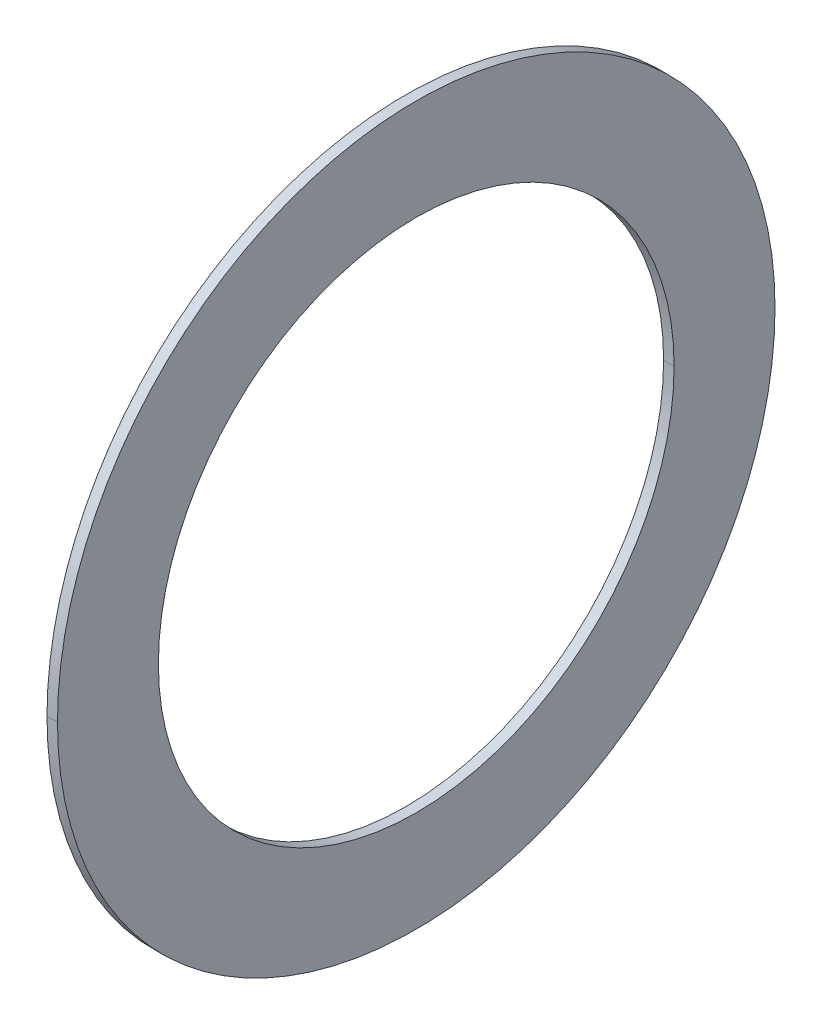
ISO-10303-21;
HEADER;
FILE_DESCRIPTION(('STEP AP214'),'2;1');
FILE_NAME('part.step','',(''),(''),'','','');
FILE_SCHEMA(('AUTOMOTIVE_DESIGN { 1 0 10303 214 1 1 1 1 }'));
ENDSEC;
DATA;
#1=APPLICATION_CONTEXT('core data for automotive mechanical design processes');
#2=APPLICATION_PROTOCOL_DEFINITION('international standard','automotive_design',2000,#1);
#3=PRODUCT_CONTEXT('',#1,'mechanical');
#4=PRODUCT('Part','Part','',(#3));
#5=PRODUCT_RELATED_PRODUCT_CATEGORY('part','',(#4));
#6=PRODUCT_DEFINITION_FORMATION('','',#4);
#7=PRODUCT_DEFINITION_CONTEXT('part definition',#1,'design');
#8=PRODUCT_DEFINITION('design','',#6,#7);
#9=PRODUCT_DEFINITION_SHAPE('','',#8);
#10=(LENGTH_UNIT() NAMED_UNIT(*) SI_UNIT(.MILLI.,.METRE.));
#11=(NAMED_UNIT(*) PLANE_ANGLE_UNIT() SI_UNIT($,.RADIAN.));
#12=(NAMED_UNIT(*) SI_UNIT($,.STERADIAN.) SOLID_ANGLE_UNIT());
#13=UNCERTAINTY_MEASURE_WITH_UNIT(LENGTH_MEASURE(1.E-05),#10,'distance_accuracy_value','');
#14=(GEOMETRIC_REPRESENTATION_CONTEXT(3) GLOBAL_UNCERTAINTY_ASSIGNED_CONTEXT((#13)) GLOBAL_UNIT_ASSIGNED_CONTEXT((#10,
#11,#12)) REPRESENTATION_CONTEXT('',''));
#15=CARTESIAN_POINT('',(0.,0.,0.));
#16=DIRECTION('',(0.,0.,1.));
#17=DIRECTION('',(1.,0.,0.));
#18=AXIS2_PLACEMENT_3D('',#15,#16,#17);
#19=CARTESIAN_POINT('',(3.75,6.4,0.));
#20=DIRECTION('',(-1.,0.,0.));
#21=DIRECTION('',(0.,0.,1.));
#22=AXIS2_PLACEMENT_3D('',#19,#20,#21);
#23=PLANE('',#22);
#24=CARTESIAN_POINT('',(3.75,0.,0.));
#25=DIRECTION('',(1.,0.,0.));
#26=DIRECTION('',(0.,0.,-1.));
#27=AXIS2_PLACEMENT_3D('',#24,#25,#26);
#28=CIRCLE('',#27,4.6);
#29=CARTESIAN_POINT('',(3.75,0.,-4.6));
#30=VERTEX_POINT('',#29);
#31=CARTESIAN_POINT('',(3.75,0.,4.6));
#32=VERTEX_POINT('',#31);
#33=EDGE_CURVE('E11',#30,#32,#28,.T.);
#34=ORIENTED_EDGE('',*,*,#33,.T.);
#35=CARTESIAN_POINT('',(3.75,0.,0.));
#36=DIRECTION('',(1.,0.,0.));
#37=DIRECTION('',(0.,0.,-1.));
#38=AXIS2_PLACEMENT_3D('',#35,#36,#37);
#39=CIRCLE('',#38,4.6);
#40=EDGE_CURVE('E25',#32,#30,#39,.T.);
#41=ORIENTED_EDGE('',*,*,#40,.T.);
#42=EDGE_LOOP('',(#34,#41));
#43=FACE_BOUND('',#42,.T.);
#44=CARTESIAN_POINT('',(3.75,0.,0.));
#45=DIRECTION('',(1.,0.,0.));
#46=DIRECTION('',(0.,0.,-1.));
#47=AXIS2_PLACEMENT_3D('',#44,#45,#46);
#48=CIRCLE('',#47,6.4);
#49=CARTESIAN_POINT('',(3.75,0.,-6.4));
#50=VERTEX_POINT('',#49);
#51=CARTESIAN_POINT('',(3.75,0.,6.4));
#52=VERTEX_POINT('',#51);
#53=EDGE_CURVE('E96',#50,#52,#48,.T.);
#54=ORIENTED_EDGE('',*,*,#53,.F.);
#55=CARTESIAN_POINT('',(3.75,0.,0.));
#56=DIRECTION('',(1.,0.,0.));
#57=DIRECTION('',(0.,0.,-1.));
#58=AXIS2_PLACEMENT_3D('',#55,#56,#57);
#59=CIRCLE('',#58,6.4);
#60=EDGE_CURVE('E91',#52,#50,#59,.T.);
#61=ORIENTED_EDGE('',*,*,#60,.F.);
#62=EDGE_LOOP('',(#54,#61));
#63=FACE_BOUND('',#62,.T.);
#64=ADVANCED_FACE('F17',(#43,#63),#23,.T.);
#65=CARTESIAN_POINT('',(3.9374,0.,0.));
#66=DIRECTION('',(-1.,0.,0.));
#67=DIRECTION('',(0.,1.,0.));
#68=AXIS2_PLACEMENT_3D('',#65,#66,#67);
#69=CYLINDRICAL_SURFACE('',#68,6.4);
#70=ORIENTED_EDGE('',*,*,#60,.T.);
#71=DIRECTION('',(-1.,0.,0.));
#72=VECTOR('',#71,1.);
#73=CARTESIAN_POINT('',(3.9374,0.,-6.4));
#74=LINE('',#73,#72);
#75=CARTESIAN_POINT('',(3.9374,0.,-6.4));
#76=VERTEX_POINT('',#75);
#77=EDGE_CURVE('E86',#76,#50,#74,.T.);
#78=ORIENTED_EDGE('',*,*,#77,.F.);
#79=CARTESIAN_POINT('',(3.9374,0.,0.));
#80=DIRECTION('',(1.,0.,0.));
#81=DIRECTION('',(0.,0.,-1.));
#82=AXIS2_PLACEMENT_3D('',#79,#80,#81);
#83=CIRCLE('',#82,6.4);
#84=CARTESIAN_POINT('',(3.9374,0.,6.4));
#85=VERTEX_POINT('',#84);
#86=EDGE_CURVE('E81',#85,#76,#83,.T.);
#87=ORIENTED_EDGE('',*,*,#86,.F.);
#88=DIRECTION('',(-1.,0.,0.));
#89=VECTOR('',#88,1.);
#90=CARTESIAN_POINT('',(3.9374,0.,6.4));
#91=LINE('',#90,#89);
#92=EDGE_CURVE('E70',#85,#52,#91,.T.);
#93=ORIENTED_EDGE('',*,*,#92,.T.);
#94=EDGE_LOOP('',(#70,#78,#87,#93));
#95=FACE_BOUND('',#94,.T.);
#96=ADVANCED_FACE('F111',(#95),#69,.T.);
#97=CARTESIAN_POINT('',(3.9374,0.,0.));
#98=DIRECTION('',(-1.,0.,0.));
#99=DIRECTION('',(0.,-1.,0.));
#100=AXIS2_PLACEMENT_3D('',#97,#98,#99);
#101=CYLINDRICAL_SURFACE('',#100,6.4);
#102=CARTESIAN_POINT('',(3.9374,0.,0.));
#103=DIRECTION('',(1.,0.,0.));
#104=DIRECTION('',(0.,0.,-1.));
#105=AXIS2_PLACEMENT_3D('',#102,#103,#104);
#106=CIRCLE('',#105,6.4);
#107=EDGE_CURVE('E67',#76,#85,#106,.T.);
#108=ORIENTED_EDGE('',*,*,#107,.F.);
#109=ORIENTED_EDGE('',*,*,#77,.T.);
#110=ORIENTED_EDGE('',*,*,#53,.T.);
#111=ORIENTED_EDGE('',*,*,#92,.F.);
#112=EDGE_LOOP('',(#108,#109,#110,#111));
#113=FACE_BOUND('',#112,.T.);
#114=ADVANCED_FACE('F108',(#113),#101,.T.);
#115=CARTESIAN_POINT('',(3.9374,4.6,0.));
#116=DIRECTION('',(1.,0.,0.));
#117=DIRECTION('',(0.,0.,-1.));
#118=AXIS2_PLACEMENT_3D('',#115,#116,#117);
#119=PLANE('',#118);
#120=ORIENTED_EDGE('',*,*,#107,.T.);
#121=ORIENTED_EDGE('',*,*,#86,.T.);
#122=EDGE_LOOP('',(#120,#121));
#123=FACE_BOUND('',#122,.T.);
#124=CARTESIAN_POINT('',(3.9374,0.,0.));
#125=DIRECTION('',(1.,0.,0.));
#126=DIRECTION('',(0.,0.,-1.));
#127=AXIS2_PLACEMENT_3D('',#124,#125,#126);
#128=CIRCLE('',#127,4.6);
#129=CARTESIAN_POINT('',(3.9374,0.,-4.6));
#130=VERTEX_POINT('',#129);
#131=CARTESIAN_POINT('',(3.9374,0.,4.6));
#132=VERTEX_POINT('',#131);
#133=EDGE_CURVE('E56',#130,#132,#128,.T.);
#134=ORIENTED_EDGE('',*,*,#133,.F.);
#135=CARTESIAN_POINT('',(3.9374,0.,0.));
#136=DIRECTION('',(1.,0.,0.));
#137=DIRECTION('',(0.,0.,-1.));
#138=AXIS2_PLACEMENT_3D('',#135,#136,#137);
#139=CIRCLE('',#138,4.6);
#140=EDGE_CURVE('E52',#132,#130,#139,.T.);
#141=ORIENTED_EDGE('',*,*,#140,.F.);
#142=EDGE_LOOP('',(#134,#141));
#143=FACE_BOUND('',#142,.T.);
#144=ADVANCED_FACE('F54',(#123,#143),#119,.T.);
#145=CARTESIAN_POINT('',(3.9374,0.,0.));
#146=DIRECTION('',(-1.,0.,0.));
#147=DIRECTION('',(0.,1.,0.));
#148=AXIS2_PLACEMENT_3D('',#145,#146,#147);
#149=CYLINDRICAL_SURFACE('',#148,4.6);
#150=ORIENTED_EDGE('',*,*,#40,.F.);
#151=DIRECTION('',(-1.,0.,0.));
#152=VECTOR('',#151,1.);
#153=CARTESIAN_POINT('',(3.9374,0.,4.6));
#154=LINE('',#153,#152);
#155=EDGE_CURVE('E59',#132,#32,#154,.T.);
#156=ORIENTED_EDGE('',*,*,#155,.F.);
#157=ORIENTED_EDGE('',*,*,#140,.T.);
#158=DIRECTION('',(-1.,0.,0.));
#159=VECTOR('',#158,1.);
#160=CARTESIAN_POINT('',(3.9374,0.,-4.6));
#161=LINE('',#160,#159);
#162=EDGE_CURVE('E64',#130,#30,#161,.T.);
#163=ORIENTED_EDGE('',*,*,#162,.T.);
#164=EDGE_LOOP('',(#150,#156,#157,#163));
#165=FACE_BOUND('',#164,.T.);
#166=ADVANCED_FACE('F62',(#165),#149,.F.);
#167=CARTESIAN_POINT('',(3.9374,0.,0.));
#168=DIRECTION('',(-1.,0.,0.));
#169=DIRECTION('',(0.,-1.,0.));
#170=AXIS2_PLACEMENT_3D('',#167,#168,#169);
#171=CYLINDRICAL_SURFACE('',#170,4.6);
#172=ORIENTED_EDGE('',*,*,#133,.T.);
#173=ORIENTED_EDGE('',*,*,#155,.T.);
#174=ORIENTED_EDGE('',*,*,#33,.F.);
#175=ORIENTED_EDGE('',*,*,#162,.F.);
#176=EDGE_LOOP('',(#172,#173,#174,#175));
#177=FACE_BOUND('',#176,.T.);
#178=ADVANCED_FACE('F66',(#177),#171,.F.);
#179=CLOSED_SHELL('',(#64,#96,#114,#144,#166,#178));
#180=MANIFOLD_SOLID_BREP('B1',#179);
#181=ADVANCED_BREP_SHAPE_REPRESENTATION('',(#18,#180),#14);
#182=SHAPE_DEFINITION_REPRESENTATION(#9,#181);
ENDSEC;
END-ISO-10303-21;
